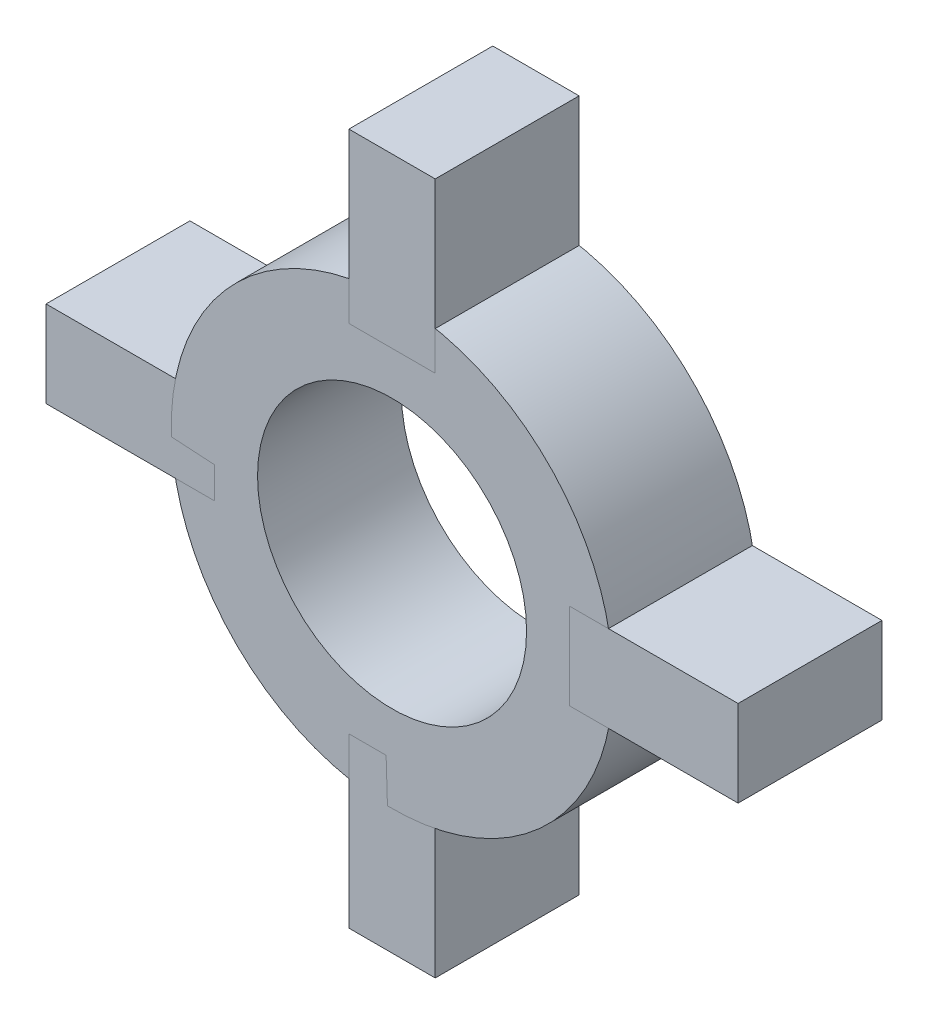
ISO-10303-21;
HEADER;
FILE_DESCRIPTION(('STEP AP214'),'2;1');
FILE_NAME('part.step','',(''),(''),'','','');
FILE_SCHEMA(('AUTOMOTIVE_DESIGN { 1 0 10303 214 1 1 1 1 }'));
ENDSEC;
DATA;
#1=APPLICATION_CONTEXT('core data for automotive mechanical design processes');
#2=APPLICATION_PROTOCOL_DEFINITION('international standard','automotive_design',2000,#1);
#3=PRODUCT_CONTEXT('',#1,'mechanical');
#4=PRODUCT('Part','Part','',(#3));
#5=PRODUCT_RELATED_PRODUCT_CATEGORY('part','',(#4));
#6=PRODUCT_DEFINITION_FORMATION('','',#4);
#7=PRODUCT_DEFINITION_CONTEXT('part definition',#1,'design');
#8=PRODUCT_DEFINITION('design','',#6,#7);
#9=PRODUCT_DEFINITION_SHAPE('','',#8);
#10=(LENGTH_UNIT() NAMED_UNIT(*) SI_UNIT(.MILLI.,.METRE.));
#11=(NAMED_UNIT(*) PLANE_ANGLE_UNIT() SI_UNIT($,.RADIAN.));
#12=(NAMED_UNIT(*) SI_UNIT($,.STERADIAN.) SOLID_ANGLE_UNIT());
#13=UNCERTAINTY_MEASURE_WITH_UNIT(LENGTH_MEASURE(1.E-05),#10,'distance_accuracy_value','');
#14=(GEOMETRIC_REPRESENTATION_CONTEXT(3) GLOBAL_UNCERTAINTY_ASSIGNED_CONTEXT((#13)) GLOBAL_UNIT_ASSIGNED_CONTEXT((#10,
#11,#12)) REPRESENTATION_CONTEXT('',''));
#15=CARTESIAN_POINT('',(0.,0.,0.));
#16=DIRECTION('',(0.,0.,1.));
#17=DIRECTION('',(1.,0.,0.));
#18=AXIS2_PLACEMENT_3D('',#15,#16,#17);
#19=CARTESIAN_POINT('',(0.,0.,5.));
#20=DIRECTION('',(0.,0.,1.));
#21=DIRECTION('',(1.,0.,0.));
#22=AXIS2_PLACEMENT_3D('',#19,#20,#21);
#23=PLANE('',#22);
#24=CARTESIAN_POINT('',(0.,0.,5.));
#25=DIRECTION('',(0.,0.,1.));
#26=DIRECTION('',(1.,0.,0.));
#27=AXIS2_PLACEMENT_3D('',#24,#25,#26);
#28=CIRCLE('',#27,7.675);
#29=CARTESIAN_POINT('',(7.675,0.,5.));
#30=VERTEX_POINT('',#29);
#31=EDGE_CURVE('E12',#30,#30,#28,.T.);
#32=ORIENTED_EDGE('',*,*,#31,.T.);
#33=EDGE_LOOP('',(#32));
#34=FACE_BOUND('',#33,.T.);
#35=CARTESIAN_POINT('',(0.,0.,5.));
#36=DIRECTION('',(0.,0.,1.));
#37=DIRECTION('',(1.,0.,0.));
#38=AXIS2_PLACEMENT_3D('',#35,#36,#37);
#39=CIRCLE('',#38,4.675);
#40=CARTESIAN_POINT('',(4.675,0.,5.));
#41=VERTEX_POINT('',#40);
#42=EDGE_CURVE('E67',#41,#41,#39,.T.);
#43=ORIENTED_EDGE('',*,*,#42,.F.);
#44=EDGE_LOOP('',(#43));
#45=FACE_BOUND('',#44,.T.);
#46=ADVANCED_FACE('F54',(#34,#45),#23,.T.);
#47=CARTESIAN_POINT('',(0.,0.,0.));
#48=DIRECTION('',(0.,0.,1.));
#49=DIRECTION('',(1.,0.,0.));
#50=AXIS2_PLACEMENT_3D('',#47,#48,#49);
#51=PLANE('',#50);
#52=CARTESIAN_POINT('',(0.,0.,0.));
#53=DIRECTION('',(0.,0.,1.));
#54=DIRECTION('',(1.,0.,0.));
#55=AXIS2_PLACEMENT_3D('',#52,#53,#54);
#56=CIRCLE('',#55,7.675);
#57=CARTESIAN_POINT('',(7.675,0.,0.));
#58=VERTEX_POINT('',#57);
#59=EDGE_CURVE('E58',#58,#58,#56,.T.);
#60=ORIENTED_EDGE('',*,*,#59,.F.);
#61=EDGE_LOOP('',(#60));
#62=FACE_BOUND('',#61,.T.);
#63=CARTESIAN_POINT('',(0.,0.,0.));
#64=DIRECTION('',(0.,0.,1.));
#65=DIRECTION('',(1.,0.,0.));
#66=AXIS2_PLACEMENT_3D('',#63,#64,#65);
#67=CIRCLE('',#66,4.675);
#68=CARTESIAN_POINT('',(4.675,0.,0.));
#69=VERTEX_POINT('',#68);
#70=EDGE_CURVE('E69',#69,#69,#67,.T.);
#71=ORIENTED_EDGE('',*,*,#70,.T.);
#72=EDGE_LOOP('',(#71));
#73=FACE_BOUND('',#72,.T.);
#74=ADVANCED_FACE('F81',(#62,#73),#51,.F.);
#75=CARTESIAN_POINT('',(0.,0.,5.));
#76=DIRECTION('',(0.,0.,-1.));
#77=DIRECTION('',(-1.,0.,0.));
#78=AXIS2_PLACEMENT_3D('',#75,#76,#77);
#79=CYLINDRICAL_SURFACE('',#78,7.675);
#80=ORIENTED_EDGE('',*,*,#31,.F.);
#81=EDGE_LOOP('',(#80));
#82=FACE_BOUND('',#81,.T.);
#83=ORIENTED_EDGE('',*,*,#59,.T.);
#84=EDGE_LOOP('',(#83));
#85=FACE_BOUND('',#84,.T.);
#86=ADVANCED_FACE('F56',(#82,#85),#79,.T.);
#87=CARTESIAN_POINT('',(0.,0.,5.));
#88=DIRECTION('',(0.,0.,-1.));
#89=DIRECTION('',(-1.,0.,0.));
#90=AXIS2_PLACEMENT_3D('',#87,#88,#89);
#91=CYLINDRICAL_SURFACE('',#90,4.675);
#92=ORIENTED_EDGE('',*,*,#42,.T.);
#93=EDGE_LOOP('',(#92));
#94=FACE_BOUND('',#93,.T.);
#95=ORIENTED_EDGE('',*,*,#70,.F.);
#96=EDGE_LOOP('',(#95));
#97=FACE_BOUND('',#96,.T.);
#98=ADVANCED_FACE('F77',(#94,#97),#91,.F.);
#99=CLOSED_SHELL('',(#46,#74,#86,#98));
#100=MANIFOLD_SOLID_BREP('B2',#99);
#101=CARTESIAN_POINT('',(-6.175,1.5,5.));
#102=DIRECTION('',(0.,-1.,0.));
#103=DIRECTION('',(0.,0.,-1.));
#104=AXIS2_PLACEMENT_3D('',#101,#102,#103);
#105=PLANE('',#104);
#106=DIRECTION('',(1.,0.,0.));
#107=VECTOR('',#106,1.);
#108=CARTESIAN_POINT('',(-6.175,1.5,0.));
#109=LINE('',#108,#107);
#110=CARTESIAN_POINT('',(-6.175,1.5,0.));
#111=VERTEX_POINT('',#110);
#112=CARTESIAN_POINT('',(-12.025,1.5,0.));
#113=VERTEX_POINT('',#112);
#114=EDGE_CURVE('E193',#111,#113,#109,.F.);
#115=ORIENTED_EDGE('',*,*,#114,.T.);
#116=DIRECTION('',(0.,0.,-1.));
#117=VECTOR('',#116,1.);
#118=CARTESIAN_POINT('',(-12.025,1.5,5.));
#119=LINE('',#118,#117);
#120=CARTESIAN_POINT('',(-12.025,1.5,5.));
#121=VERTEX_POINT('',#120);
#122=EDGE_CURVE('E52',#121,#113,#119,.T.);
#123=ORIENTED_EDGE('',*,*,#122,.F.);
#124=DIRECTION('',(1.,0.,0.));
#125=VECTOR('',#124,1.);
#126=CARTESIAN_POINT('',(-6.175,1.5,5.));
#127=LINE('',#126,#125);
#128=CARTESIAN_POINT('',(-6.175,1.5,5.));
#129=VERTEX_POINT('',#128);
#130=EDGE_CURVE('E170',#129,#121,#127,.F.);
#131=ORIENTED_EDGE('',*,*,#130,.F.);
#132=DIRECTION('',(0.,0.,-1.));
#133=VECTOR('',#132,1.);
#134=CARTESIAN_POINT('',(-6.175,1.5,5.));
#135=LINE('',#134,#133);
#136=EDGE_CURVE('E146',#129,#111,#135,.T.);
#137=ORIENTED_EDGE('',*,*,#136,.T.);
#138=EDGE_LOOP('',(#115,#123,#131,#137));
#139=FACE_BOUND('',#138,.T.);
#140=ADVANCED_FACE('F130',(#139),#105,.F.);
#141=CARTESIAN_POINT('',(-12.025,-1.5,5.));
#142=DIRECTION('',(-1.,0.,0.));
#143=DIRECTION('',(0.,0.,1.));
#144=AXIS2_PLACEMENT_3D('',#141,#142,#143);
#145=PLANE('',#144);
#146=DIRECTION('',(0.,1.,0.));
#147=VECTOR('',#146,1.);
#148=CARTESIAN_POINT('',(-12.025,-1.5,0.));
#149=LINE('',#148,#147);
#150=CARTESIAN_POINT('',(-12.025,-1.5,0.));
#151=VERTEX_POINT('',#150);
#152=EDGE_CURVE('E179',#151,#113,#149,.T.);
#153=ORIENTED_EDGE('',*,*,#152,.F.);
#154=DIRECTION('',(0.,0.,-1.));
#155=VECTOR('',#154,1.);
#156=CARTESIAN_POINT('',(-12.025,-1.5,5.));
#157=LINE('',#156,#155);
#158=CARTESIAN_POINT('',(-12.025,-1.5,5.));
#159=VERTEX_POINT('',#158);
#160=EDGE_CURVE('E138',#159,#151,#157,.T.);
#161=ORIENTED_EDGE('',*,*,#160,.F.);
#162=DIRECTION('',(0.,1.,0.));
#163=VECTOR('',#162,1.);
#164=CARTESIAN_POINT('',(-12.025,-1.5,5.));
#165=LINE('',#164,#163);
#166=EDGE_CURVE('E177',#159,#121,#165,.T.);
#167=ORIENTED_EDGE('',*,*,#166,.T.);
#168=ORIENTED_EDGE('',*,*,#122,.T.);
#169=EDGE_LOOP('',(#153,#161,#167,#168));
#170=FACE_BOUND('',#169,.T.);
#171=ADVANCED_FACE('F176',(#170),#145,.T.);
#172=CARTESIAN_POINT('',(-6.175,-1.5,5.));
#173=DIRECTION('',(0.,-1.,0.));
#174=DIRECTION('',(0.,0.,-1.));
#175=AXIS2_PLACEMENT_3D('',#172,#173,#174);
#176=PLANE('',#175);
#177=DIRECTION('',(1.,0.,0.));
#178=VECTOR('',#177,1.);
#179=CARTESIAN_POINT('',(-6.175,-1.5,0.));
#180=LINE('',#179,#178);
#181=CARTESIAN_POINT('',(-6.175,-1.5,0.));
#182=VERTEX_POINT('',#181);
#183=EDGE_CURVE('E196',#182,#151,#180,.F.);
#184=ORIENTED_EDGE('',*,*,#183,.F.);
#185=DIRECTION('',(0.,0.,-1.));
#186=VECTOR('',#185,1.);
#187=CARTESIAN_POINT('',(-6.175,-1.5,5.));
#188=LINE('',#187,#186);
#189=CARTESIAN_POINT('',(-6.175,-1.5,5.));
#190=VERTEX_POINT('',#189);
#191=EDGE_CURVE('E159',#190,#182,#188,.T.);
#192=ORIENTED_EDGE('',*,*,#191,.F.);
#193=DIRECTION('',(1.,0.,0.));
#194=VECTOR('',#193,1.);
#195=CARTESIAN_POINT('',(-6.175,-1.5,5.));
#196=LINE('',#195,#194);
#197=EDGE_CURVE('E185',#190,#159,#196,.F.);
#198=ORIENTED_EDGE('',*,*,#197,.T.);
#199=ORIENTED_EDGE('',*,*,#160,.T.);
#200=EDGE_LOOP('',(#184,#192,#198,#199));
#201=FACE_BOUND('',#200,.T.);
#202=ADVANCED_FACE('F187',(#201),#176,.T.);
#203=CARTESIAN_POINT('',(-6.175,1.5,5.));
#204=DIRECTION('',(1.,0.,0.));
#205=DIRECTION('',(0.,0.,-1.));
#206=AXIS2_PLACEMENT_3D('',#203,#204,#205);
#207=PLANE('',#206);
#208=DIRECTION('',(0.,-1.,0.));
#209=VECTOR('',#208,1.);
#210=CARTESIAN_POINT('',(-6.175,1.5,0.));
#211=LINE('',#210,#209);
#212=EDGE_CURVE('E198',#111,#182,#211,.T.);
#213=ORIENTED_EDGE('',*,*,#212,.F.);
#214=ORIENTED_EDGE('',*,*,#136,.F.);
#215=DIRECTION('',(0.,-1.,0.));
#216=VECTOR('',#215,1.);
#217=CARTESIAN_POINT('',(-6.175,1.5,5.));
#218=LINE('',#217,#216);
#219=EDGE_CURVE('E188',#129,#190,#218,.T.);
#220=ORIENTED_EDGE('',*,*,#219,.T.);
#221=ORIENTED_EDGE('',*,*,#191,.T.);
#222=EDGE_LOOP('',(#213,#214,#220,#221));
#223=FACE_BOUND('',#222,.T.);
#224=ADVANCED_FACE('F204',(#223),#207,.T.);
#225=CARTESIAN_POINT('',(0.,0.,5.));
#226=DIRECTION('',(0.,0.,1.));
#227=DIRECTION('',(1.,0.,0.));
#228=AXIS2_PLACEMENT_3D('',#225,#226,#227);
#229=PLANE('',#228);
#230=ORIENTED_EDGE('',*,*,#130,.T.);
#231=ORIENTED_EDGE('',*,*,#166,.F.);
#232=ORIENTED_EDGE('',*,*,#197,.F.);
#233=ORIENTED_EDGE('',*,*,#219,.F.);
#234=EDGE_LOOP('',(#230,#231,#232,#233));
#235=FACE_BOUND('',#234,.T.);
#236=ADVANCED_FACE('F184',(#235),#229,.T.);
#237=CARTESIAN_POINT('',(0.,0.,0.));
#238=DIRECTION('',(0.,0.,1.));
#239=DIRECTION('',(1.,0.,0.));
#240=AXIS2_PLACEMENT_3D('',#237,#238,#239);
#241=PLANE('',#240);
#242=ORIENTED_EDGE('',*,*,#114,.F.);
#243=ORIENTED_EDGE('',*,*,#212,.T.);
#244=ORIENTED_EDGE('',*,*,#183,.T.);
#245=ORIENTED_EDGE('',*,*,#152,.T.);
#246=EDGE_LOOP('',(#242,#243,#244,#245));
#247=FACE_BOUND('',#246,.T.);
#248=ADVANCED_FACE('F203',(#247),#241,.F.);
#249=CLOSED_SHELL('',(#140,#171,#202,#224,#236,#248));
#250=MANIFOLD_SOLID_BREP('B7',#249);
#251=CARTESIAN_POINT('',(6.175,-1.5,5.));
#252=DIRECTION('',(0.,1.,0.));
#253=DIRECTION('',(0.,0.,1.));
#254=AXIS2_PLACEMENT_3D('',#251,#252,#253);
#255=PLANE('',#254);
#256=DIRECTION('',(1.,0.,0.));
#257=VECTOR('',#256,1.);
#258=CARTESIAN_POINT('',(6.175,-1.5,0.));
#259=LINE('',#258,#257);
#260=CARTESIAN_POINT('',(6.175,-1.5,0.));
#261=VERTEX_POINT('',#260);
#262=CARTESIAN_POINT('',(12.025,-1.5,0.));
#263=VERTEX_POINT('',#262);
#264=EDGE_CURVE('E327',#261,#263,#259,.T.);
#265=ORIENTED_EDGE('',*,*,#264,.T.);
#266=DIRECTION('',(0.,0.,-1.));
#267=VECTOR('',#266,1.);
#268=CARTESIAN_POINT('',(12.025,-1.5,5.));
#269=LINE('',#268,#267);
#270=CARTESIAN_POINT('',(12.025,-1.5,5.));
#271=VERTEX_POINT('',#270);
#272=EDGE_CURVE('E128',#271,#263,#269,.T.);
#273=ORIENTED_EDGE('',*,*,#272,.F.);
#274=DIRECTION('',(1.,0.,0.));
#275=VECTOR('',#274,1.);
#276=CARTESIAN_POINT('',(6.175,-1.5,5.));
#277=LINE('',#276,#275);
#278=CARTESIAN_POINT('',(6.175,-1.5,5.));
#279=VERTEX_POINT('',#278);
#280=EDGE_CURVE('E304',#279,#271,#277,.T.);
#281=ORIENTED_EDGE('',*,*,#280,.F.);
#282=DIRECTION('',(0.,0.,-1.));
#283=VECTOR('',#282,1.);
#284=CARTESIAN_POINT('',(6.175,-1.5,5.));
#285=LINE('',#284,#283);
#286=EDGE_CURVE('E280',#279,#261,#285,.T.);
#287=ORIENTED_EDGE('',*,*,#286,.T.);
#288=EDGE_LOOP('',(#265,#273,#281,#287));
#289=FACE_BOUND('',#288,.T.);
#290=ADVANCED_FACE('F264',(#289),#255,.F.);
#291=CARTESIAN_POINT('',(12.025,1.5,5.));
#292=DIRECTION('',(1.,0.,0.));
#293=DIRECTION('',(0.,0.,-1.));
#294=AXIS2_PLACEMENT_3D('',#291,#292,#293);
#295=PLANE('',#294);
#296=DIRECTION('',(0.,-1.,0.));
#297=VECTOR('',#296,1.);
#298=CARTESIAN_POINT('',(12.025,1.5,0.));
#299=LINE('',#298,#297);
#300=CARTESIAN_POINT('',(12.025,1.5,0.));
#301=VERTEX_POINT('',#300);
#302=EDGE_CURVE('E313',#301,#263,#299,.T.);
#303=ORIENTED_EDGE('',*,*,#302,.F.);
#304=DIRECTION('',(0.,0.,-1.));
#305=VECTOR('',#304,1.);
#306=CARTESIAN_POINT('',(12.025,1.5,5.));
#307=LINE('',#306,#305);
#308=CARTESIAN_POINT('',(12.025,1.5,5.));
#309=VERTEX_POINT('',#308);
#310=EDGE_CURVE('E272',#309,#301,#307,.T.);
#311=ORIENTED_EDGE('',*,*,#310,.F.);
#312=DIRECTION('',(0.,-1.,0.));
#313=VECTOR('',#312,1.);
#314=CARTESIAN_POINT('',(12.025,1.5,5.));
#315=LINE('',#314,#313);
#316=EDGE_CURVE('E311',#309,#271,#315,.T.);
#317=ORIENTED_EDGE('',*,*,#316,.T.);
#318=ORIENTED_EDGE('',*,*,#272,.T.);
#319=EDGE_LOOP('',(#303,#311,#317,#318));
#320=FACE_BOUND('',#319,.T.);
#321=ADVANCED_FACE('F310',(#320),#295,.T.);
#322=CARTESIAN_POINT('',(6.175,1.5,5.));
#323=DIRECTION('',(0.,1.,0.));
#324=DIRECTION('',(0.,0.,1.));
#325=AXIS2_PLACEMENT_3D('',#322,#323,#324);
#326=PLANE('',#325);
#327=DIRECTION('',(1.,0.,0.));
#328=VECTOR('',#327,1.);
#329=CARTESIAN_POINT('',(6.175,1.5,0.));
#330=LINE('',#329,#328);
#331=CARTESIAN_POINT('',(6.175,1.5,0.));
#332=VERTEX_POINT('',#331);
#333=EDGE_CURVE('E330',#332,#301,#330,.T.);
#334=ORIENTED_EDGE('',*,*,#333,.F.);
#335=DIRECTION('',(0.,0.,-1.));
#336=VECTOR('',#335,1.);
#337=CARTESIAN_POINT('',(6.175,1.5,5.));
#338=LINE('',#337,#336);
#339=CARTESIAN_POINT('',(6.175,1.5,5.));
#340=VERTEX_POINT('',#339);
#341=EDGE_CURVE('E293',#340,#332,#338,.T.);
#342=ORIENTED_EDGE('',*,*,#341,.F.);
#343=DIRECTION('',(1.,0.,0.));
#344=VECTOR('',#343,1.);
#345=CARTESIAN_POINT('',(6.175,1.5,5.));
#346=LINE('',#345,#344);
#347=EDGE_CURVE('E319',#340,#309,#346,.T.);
#348=ORIENTED_EDGE('',*,*,#347,.T.);
#349=ORIENTED_EDGE('',*,*,#310,.T.);
#350=EDGE_LOOP('',(#334,#342,#348,#349));
#351=FACE_BOUND('',#350,.T.);
#352=ADVANCED_FACE('F321',(#351),#326,.T.);
#353=CARTESIAN_POINT('',(6.175,-1.5,5.));
#354=DIRECTION('',(-1.,0.,0.));
#355=DIRECTION('',(0.,0.,1.));
#356=AXIS2_PLACEMENT_3D('',#353,#354,#355);
#357=PLANE('',#356);
#358=DIRECTION('',(0.,1.,0.));
#359=VECTOR('',#358,1.);
#360=CARTESIAN_POINT('',(6.175,-1.5,0.));
#361=LINE('',#360,#359);
#362=EDGE_CURVE('E332',#261,#332,#361,.T.);
#363=ORIENTED_EDGE('',*,*,#362,.F.);
#364=ORIENTED_EDGE('',*,*,#286,.F.);
#365=DIRECTION('',(0.,1.,0.));
#366=VECTOR('',#365,1.);
#367=CARTESIAN_POINT('',(6.175,-1.5,5.));
#368=LINE('',#367,#366);
#369=EDGE_CURVE('E322',#279,#340,#368,.T.);
#370=ORIENTED_EDGE('',*,*,#369,.T.);
#371=ORIENTED_EDGE('',*,*,#341,.T.);
#372=EDGE_LOOP('',(#363,#364,#370,#371));
#373=FACE_BOUND('',#372,.T.);
#374=ADVANCED_FACE('F338',(#373),#357,.T.);
#375=CARTESIAN_POINT('',(0.,0.,5.));
#376=DIRECTION('',(0.,0.,-1.));
#377=DIRECTION('',(-1.,0.,0.));
#378=AXIS2_PLACEMENT_3D('',#375,#376,#377);
#379=PLANE('',#378);
#380=ORIENTED_EDGE('',*,*,#280,.T.);
#381=ORIENTED_EDGE('',*,*,#316,.F.);
#382=ORIENTED_EDGE('',*,*,#347,.F.);
#383=ORIENTED_EDGE('',*,*,#369,.F.);
#384=EDGE_LOOP('',(#380,#381,#382,#383));
#385=FACE_BOUND('',#384,.T.);
#386=ADVANCED_FACE('F318',(#385),#379,.F.);
#387=CARTESIAN_POINT('',(0.,0.,0.));
#388=DIRECTION('',(0.,0.,-1.));
#389=DIRECTION('',(-1.,0.,0.));
#390=AXIS2_PLACEMENT_3D('',#387,#388,#389);
#391=PLANE('',#390);
#392=ORIENTED_EDGE('',*,*,#264,.F.);
#393=ORIENTED_EDGE('',*,*,#362,.T.);
#394=ORIENTED_EDGE('',*,*,#333,.T.);
#395=ORIENTED_EDGE('',*,*,#302,.T.);
#396=EDGE_LOOP('',(#392,#393,#394,#395));
#397=FACE_BOUND('',#396,.T.);
#398=ADVANCED_FACE('F337',(#397),#391,.T.);
#399=CLOSED_SHELL('',(#290,#321,#352,#374,#386,#398));
#400=MANIFOLD_SOLID_BREP('B46',#399);
#401=CARTESIAN_POINT('',(-1.5,-6.175,5.));
#402=DIRECTION('',(1.,0.,0.));
#403=DIRECTION('',(0.,0.,-1.));
#404=AXIS2_PLACEMENT_3D('',#401,#402,#403);
#405=PLANE('',#404);
#406=DIRECTION('',(0.,1.,0.));
#407=VECTOR('',#406,1.);
#408=CARTESIAN_POINT('',(-1.5,-6.175,0.));
#409=LINE('',#408,#407);
#410=CARTESIAN_POINT('',(-1.5,-6.175,0.));
#411=VERTEX_POINT('',#410);
#412=CARTESIAN_POINT('',(-1.5,-12.025,0.));
#413=VERTEX_POINT('',#412);
#414=EDGE_CURVE('E460',#411,#413,#409,.F.);
#415=ORIENTED_EDGE('',*,*,#414,.T.);
#416=DIRECTION('',(0.,0.,-1.));
#417=VECTOR('',#416,1.);
#418=CARTESIAN_POINT('',(-1.5,-12.025,5.));
#419=LINE('',#418,#417);
#420=CARTESIAN_POINT('',(-1.5,-12.025,5.));
#421=VERTEX_POINT('',#420);
#422=EDGE_CURVE('E262',#421,#413,#419,.T.);
#423=ORIENTED_EDGE('',*,*,#422,.F.);
#424=DIRECTION('',(0.,1.,0.));
#425=VECTOR('',#424,1.);
#426=CARTESIAN_POINT('',(-1.5,-6.175,5.));
#427=LINE('',#426,#425);
#428=CARTESIAN_POINT('',(-1.5,-6.175,5.));
#429=VERTEX_POINT('',#428);
#430=EDGE_CURVE('E437',#429,#421,#427,.F.);
#431=ORIENTED_EDGE('',*,*,#430,.F.);
#432=DIRECTION('',(0.,0.,-1.));
#433=VECTOR('',#432,1.);
#434=CARTESIAN_POINT('',(-1.5,-6.175,5.));
#435=LINE('',#434,#433);
#436=EDGE_CURVE('E413',#429,#411,#435,.T.);
#437=ORIENTED_EDGE('',*,*,#436,.T.);
#438=EDGE_LOOP('',(#415,#423,#431,#437));
#439=FACE_BOUND('',#438,.T.);
#440=ADVANCED_FACE('F397',(#439),#405,.F.);
#441=CARTESIAN_POINT('',(1.5,-12.025,5.));
#442=DIRECTION('',(0.,-1.,0.));
#443=DIRECTION('',(0.,0.,-1.));
#444=AXIS2_PLACEMENT_3D('',#441,#442,#443);
#445=PLANE('',#444);
#446=DIRECTION('',(-1.,0.,0.));
#447=VECTOR('',#446,1.);
#448=CARTESIAN_POINT('',(1.5,-12.025,0.));
#449=LINE('',#448,#447);
#450=CARTESIAN_POINT('',(1.5,-12.025,0.));
#451=VERTEX_POINT('',#450);
#452=EDGE_CURVE('E446',#451,#413,#449,.T.);
#453=ORIENTED_EDGE('',*,*,#452,.F.);
#454=DIRECTION('',(0.,0.,-1.));
#455=VECTOR('',#454,1.);
#456=CARTESIAN_POINT('',(1.5,-12.025,5.));
#457=LINE('',#456,#455);
#458=CARTESIAN_POINT('',(1.5,-12.025,5.));
#459=VERTEX_POINT('',#458);
#460=EDGE_CURVE('E405',#459,#451,#457,.T.);
#461=ORIENTED_EDGE('',*,*,#460,.F.);
#462=DIRECTION('',(-1.,0.,0.));
#463=VECTOR('',#462,1.);
#464=CARTESIAN_POINT('',(1.5,-12.025,5.));
#465=LINE('',#464,#463);
#466=EDGE_CURVE('E444',#459,#421,#465,.T.);
#467=ORIENTED_EDGE('',*,*,#466,.T.);
#468=ORIENTED_EDGE('',*,*,#422,.T.);
#469=EDGE_LOOP('',(#453,#461,#467,#468));
#470=FACE_BOUND('',#469,.T.);
#471=ADVANCED_FACE('F443',(#470),#445,.T.);
#472=CARTESIAN_POINT('',(1.5,-6.175,5.));
#473=DIRECTION('',(1.,0.,0.));
#474=DIRECTION('',(0.,0.,-1.));
#475=AXIS2_PLACEMENT_3D('',#472,#473,#474);
#476=PLANE('',#475);
#477=DIRECTION('',(0.,1.,0.));
#478=VECTOR('',#477,1.);
#479=CARTESIAN_POINT('',(1.5,-6.175,0.));
#480=LINE('',#479,#478);
#481=CARTESIAN_POINT('',(1.5,-6.175,0.));
#482=VERTEX_POINT('',#481);
#483=EDGE_CURVE('E463',#482,#451,#480,.F.);
#484=ORIENTED_EDGE('',*,*,#483,.F.);
#485=DIRECTION('',(0.,0.,-1.));
#486=VECTOR('',#485,1.);
#487=CARTESIAN_POINT('',(1.5,-6.175,5.));
#488=LINE('',#487,#486);
#489=CARTESIAN_POINT('',(1.5,-6.175,5.));
#490=VERTEX_POINT('',#489);
#491=EDGE_CURVE('E426',#490,#482,#488,.T.);
#492=ORIENTED_EDGE('',*,*,#491,.F.);
#493=DIRECTION('',(0.,1.,0.));
#494=VECTOR('',#493,1.);
#495=CARTESIAN_POINT('',(1.5,-6.175,5.));
#496=LINE('',#495,#494);
#497=EDGE_CURVE('E452',#490,#459,#496,.F.);
#498=ORIENTED_EDGE('',*,*,#497,.T.);
#499=ORIENTED_EDGE('',*,*,#460,.T.);
#500=EDGE_LOOP('',(#484,#492,#498,#499));
#501=FACE_BOUND('',#500,.T.);
#502=ADVANCED_FACE('F454',(#501),#476,.T.);
#503=CARTESIAN_POINT('',(-1.5,-6.175,5.));
#504=DIRECTION('',(0.,1.,0.));
#505=DIRECTION('',(0.,0.,1.));
#506=AXIS2_PLACEMENT_3D('',#503,#504,#505);
#507=PLANE('',#506);
#508=DIRECTION('',(1.,0.,0.));
#509=VECTOR('',#508,1.);
#510=CARTESIAN_POINT('',(-1.5,-6.175,0.));
#511=LINE('',#510,#509);
#512=EDGE_CURVE('E465',#411,#482,#511,.T.);
#513=ORIENTED_EDGE('',*,*,#512,.F.);
#514=ORIENTED_EDGE('',*,*,#436,.F.);
#515=DIRECTION('',(1.,0.,0.));
#516=VECTOR('',#515,1.);
#517=CARTESIAN_POINT('',(-1.5,-6.175,5.));
#518=LINE('',#517,#516);
#519=EDGE_CURVE('E455',#429,#490,#518,.T.);
#520=ORIENTED_EDGE('',*,*,#519,.T.);
#521=ORIENTED_EDGE('',*,*,#491,.T.);
#522=EDGE_LOOP('',(#513,#514,#520,#521));
#523=FACE_BOUND('',#522,.T.);
#524=ADVANCED_FACE('F471',(#523),#507,.T.);
#525=CARTESIAN_POINT('',(0.,0.,5.));
#526=DIRECTION('',(0.,0.,1.));
#527=DIRECTION('',(1.,0.,0.));
#528=AXIS2_PLACEMENT_3D('',#525,#526,#527);
#529=PLANE('',#528);
#530=ORIENTED_EDGE('',*,*,#430,.T.);
#531=ORIENTED_EDGE('',*,*,#466,.F.);
#532=ORIENTED_EDGE('',*,*,#497,.F.);
#533=ORIENTED_EDGE('',*,*,#519,.F.);
#534=EDGE_LOOP('',(#530,#531,#532,#533));
#535=FACE_BOUND('',#534,.T.);
#536=ADVANCED_FACE('F451',(#535),#529,.T.);
#537=CARTESIAN_POINT('',(0.,0.,0.));
#538=DIRECTION('',(0.,0.,1.));
#539=DIRECTION('',(1.,0.,0.));
#540=AXIS2_PLACEMENT_3D('',#537,#538,#539);
#541=PLANE('',#540);
#542=ORIENTED_EDGE('',*,*,#414,.F.);
#543=ORIENTED_EDGE('',*,*,#512,.T.);
#544=ORIENTED_EDGE('',*,*,#483,.T.);
#545=ORIENTED_EDGE('',*,*,#452,.T.);
#546=EDGE_LOOP('',(#542,#543,#544,#545));
#547=FACE_BOUND('',#546,.T.);
#548=ADVANCED_FACE('F470',(#547),#541,.F.);
#549=CLOSED_SHELL('',(#440,#471,#502,#524,#536,#548));
#550=MANIFOLD_SOLID_BREP('B122',#549);
#551=CARTESIAN_POINT('',(1.5,6.175,5.));
#552=DIRECTION('',(-1.,0.,0.));
#553=DIRECTION('',(0.,0.,1.));
#554=AXIS2_PLACEMENT_3D('',#551,#552,#553);
#555=PLANE('',#554);
#556=DIRECTION('',(0.,1.,0.));
#557=VECTOR('',#556,1.);
#558=CARTESIAN_POINT('',(1.5,6.175,0.));
#559=LINE('',#558,#557);
#560=CARTESIAN_POINT('',(1.5,6.175,0.));
#561=VERTEX_POINT('',#560);
#562=CARTESIAN_POINT('',(1.5,12.025,0.));
#563=VERTEX_POINT('',#562);
#564=EDGE_CURVE('E584',#561,#563,#559,.T.);
#565=ORIENTED_EDGE('',*,*,#564,.T.);
#566=DIRECTION('',(0.,0.,-1.));
#567=VECTOR('',#566,1.);
#568=CARTESIAN_POINT('',(1.5,12.025,5.));
#569=LINE('',#568,#567);
#570=CARTESIAN_POINT('',(1.5,12.025,5.));
#571=VERTEX_POINT('',#570);
#572=EDGE_CURVE('E395',#571,#563,#569,.T.);
#573=ORIENTED_EDGE('',*,*,#572,.F.);
#574=DIRECTION('',(0.,1.,0.));
#575=VECTOR('',#574,1.);
#576=CARTESIAN_POINT('',(1.5,6.175,5.));
#577=LINE('',#576,#575);
#578=CARTESIAN_POINT('',(1.5,6.175,5.));
#579=VERTEX_POINT('',#578);
#580=EDGE_CURVE('E561',#579,#571,#577,.T.);
#581=ORIENTED_EDGE('',*,*,#580,.F.);
#582=DIRECTION('',(0.,0.,-1.));
#583=VECTOR('',#582,1.);
#584=CARTESIAN_POINT('',(1.5,6.175,5.));
#585=LINE('',#584,#583);
#586=EDGE_CURVE('E537',#579,#561,#585,.T.);
#587=ORIENTED_EDGE('',*,*,#586,.T.);
#588=EDGE_LOOP('',(#565,#573,#581,#587));
#589=FACE_BOUND('',#588,.T.);
#590=ADVANCED_FACE('F521',(#589),#555,.F.);
#591=CARTESIAN_POINT('',(-1.5,12.025,5.));
#592=DIRECTION('',(0.,1.,0.));
#593=DIRECTION('',(0.,0.,1.));
#594=AXIS2_PLACEMENT_3D('',#591,#592,#593);
#595=PLANE('',#594);
#596=DIRECTION('',(1.,0.,0.));
#597=VECTOR('',#596,1.);
#598=CARTESIAN_POINT('',(-1.5,12.025,0.));
#599=LINE('',#598,#597);
#600=CARTESIAN_POINT('',(-1.5,12.025,0.));
#601=VERTEX_POINT('',#600);
#602=EDGE_CURVE('E570',#601,#563,#599,.T.);
#603=ORIENTED_EDGE('',*,*,#602,.F.);
#604=DIRECTION('',(0.,0.,-1.));
#605=VECTOR('',#604,1.);
#606=CARTESIAN_POINT('',(-1.5,12.025,5.));
#607=LINE('',#606,#605);
#608=CARTESIAN_POINT('',(-1.5,12.025,5.));
#609=VERTEX_POINT('',#608);
#610=EDGE_CURVE('E529',#609,#601,#607,.T.);
#611=ORIENTED_EDGE('',*,*,#610,.F.);
#612=DIRECTION('',(1.,0.,0.));
#613=VECTOR('',#612,1.);
#614=CARTESIAN_POINT('',(-1.5,12.025,5.));
#615=LINE('',#614,#613);
#616=EDGE_CURVE('E568',#609,#571,#615,.T.);
#617=ORIENTED_EDGE('',*,*,#616,.T.);
#618=ORIENTED_EDGE('',*,*,#572,.T.);
#619=EDGE_LOOP('',(#603,#611,#617,#618));
#620=FACE_BOUND('',#619,.T.);
#621=ADVANCED_FACE('F567',(#620),#595,.T.);
#622=CARTESIAN_POINT('',(-1.5,6.175,5.));
#623=DIRECTION('',(-1.,0.,0.));
#624=DIRECTION('',(0.,0.,1.));
#625=AXIS2_PLACEMENT_3D('',#622,#623,#624);
#626=PLANE('',#625);
#627=DIRECTION('',(0.,1.,0.));
#628=VECTOR('',#627,1.);
#629=CARTESIAN_POINT('',(-1.5,6.175,0.));
#630=LINE('',#629,#628);
#631=CARTESIAN_POINT('',(-1.5,6.175,0.));
#632=VERTEX_POINT('',#631);
#633=EDGE_CURVE('E587',#632,#601,#630,.T.);
#634=ORIENTED_EDGE('',*,*,#633,.F.);
#635=DIRECTION('',(0.,0.,-1.));
#636=VECTOR('',#635,1.);
#637=CARTESIAN_POINT('',(-1.5,6.175,5.));
#638=LINE('',#637,#636);
#639=CARTESIAN_POINT('',(-1.5,6.175,5.));
#640=VERTEX_POINT('',#639);
#641=EDGE_CURVE('E550',#640,#632,#638,.T.);
#642=ORIENTED_EDGE('',*,*,#641,.F.);
#643=DIRECTION('',(0.,1.,0.));
#644=VECTOR('',#643,1.);
#645=CARTESIAN_POINT('',(-1.5,6.175,5.));
#646=LINE('',#645,#644);
#647=EDGE_CURVE('E576',#640,#609,#646,.T.);
#648=ORIENTED_EDGE('',*,*,#647,.T.);
#649=ORIENTED_EDGE('',*,*,#610,.T.);
#650=EDGE_LOOP('',(#634,#642,#648,#649));
#651=FACE_BOUND('',#650,.T.);
#652=ADVANCED_FACE('F578',(#651),#626,.T.);
#653=CARTESIAN_POINT('',(1.5,6.175,5.));
#654=DIRECTION('',(0.,-1.,0.));
#655=DIRECTION('',(0.,0.,-1.));
#656=AXIS2_PLACEMENT_3D('',#653,#654,#655);
#657=PLANE('',#656);
#658=DIRECTION('',(-1.,0.,0.));
#659=VECTOR('',#658,1.);
#660=CARTESIAN_POINT('',(1.5,6.175,0.));
#661=LINE('',#660,#659);
#662=EDGE_CURVE('E589',#561,#632,#661,.T.);
#663=ORIENTED_EDGE('',*,*,#662,.F.);
#664=ORIENTED_EDGE('',*,*,#586,.F.);
#665=DIRECTION('',(-1.,0.,0.));
#666=VECTOR('',#665,1.);
#667=CARTESIAN_POINT('',(1.5,6.175,5.));
#668=LINE('',#667,#666);
#669=EDGE_CURVE('E579',#579,#640,#668,.T.);
#670=ORIENTED_EDGE('',*,*,#669,.T.);
#671=ORIENTED_EDGE('',*,*,#641,.T.);
#672=EDGE_LOOP('',(#663,#664,#670,#671));
#673=FACE_BOUND('',#672,.T.);
#674=ADVANCED_FACE('F595',(#673),#657,.T.);
#675=CARTESIAN_POINT('',(0.,0.,5.));
#676=DIRECTION('',(0.,0.,-1.));
#677=DIRECTION('',(-1.,0.,0.));
#678=AXIS2_PLACEMENT_3D('',#675,#676,#677);
#679=PLANE('',#678);
#680=ORIENTED_EDGE('',*,*,#580,.T.);
#681=ORIENTED_EDGE('',*,*,#616,.F.);
#682=ORIENTED_EDGE('',*,*,#647,.F.);
#683=ORIENTED_EDGE('',*,*,#669,.F.);
#684=EDGE_LOOP('',(#680,#681,#682,#683));
#685=FACE_BOUND('',#684,.T.);
#686=ADVANCED_FACE('F575',(#685),#679,.F.);
#687=CARTESIAN_POINT('',(0.,0.,0.));
#688=DIRECTION('',(0.,0.,-1.));
#689=DIRECTION('',(-1.,0.,0.));
#690=AXIS2_PLACEMENT_3D('',#687,#688,#689);
#691=PLANE('',#690);
#692=ORIENTED_EDGE('',*,*,#564,.F.);
#693=ORIENTED_EDGE('',*,*,#662,.T.);
#694=ORIENTED_EDGE('',*,*,#633,.T.);
#695=ORIENTED_EDGE('',*,*,#602,.T.);
#696=EDGE_LOOP('',(#692,#693,#694,#695));
#697=FACE_BOUND('',#696,.T.);
#698=ADVANCED_FACE('F594',(#697),#691,.T.);
#699=CLOSED_SHELL('',(#590,#621,#652,#674,#686,#698));
#700=MANIFOLD_SOLID_BREP('B256',#699);
#701=ADVANCED_BREP_SHAPE_REPRESENTATION('',(#18,#100,#250,#400,#550,#700),#14);
#702=SHAPE_DEFINITION_REPRESENTATION(#9,#701);
ENDSEC;
END-ISO-10303-21;
